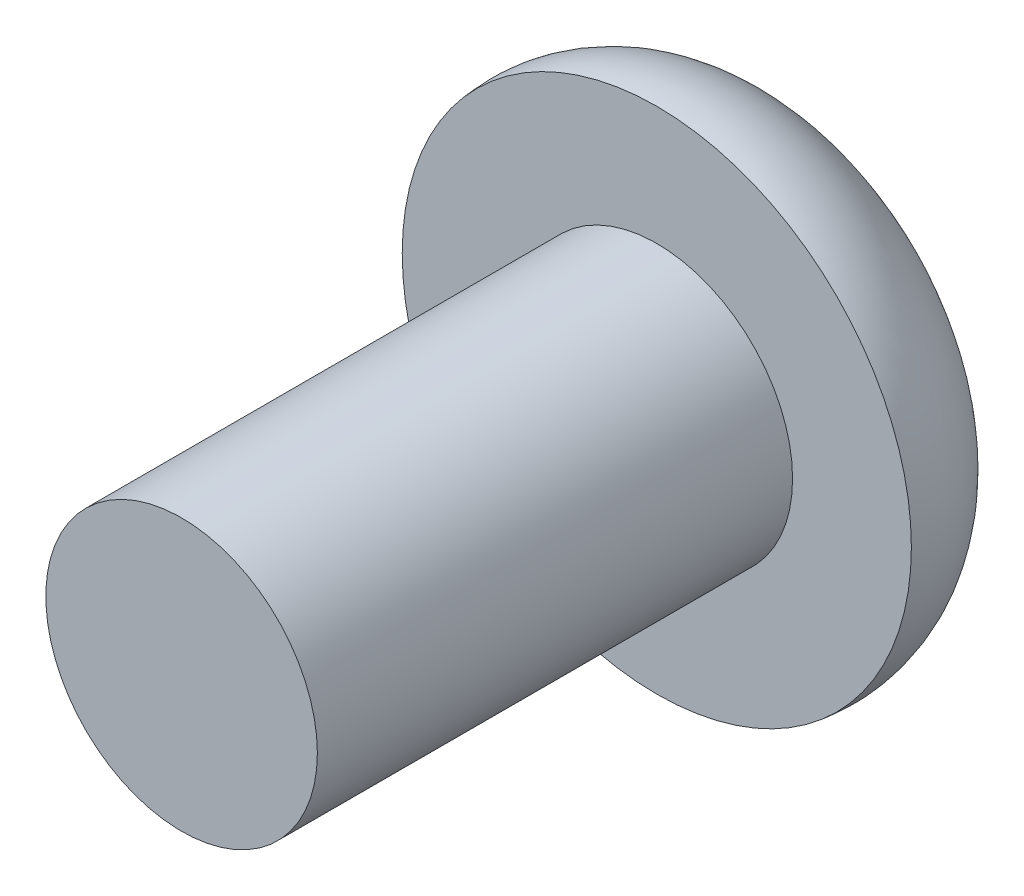
ISO-10303-21;
HEADER;
FILE_DESCRIPTION(('STEP AP214'),'2;1');
FILE_NAME('part.step','',(''),(''),'','','');
FILE_SCHEMA(('AUTOMOTIVE_DESIGN { 1 0 10303 214 1 1 1 1 }'));
ENDSEC;
DATA;
#1=APPLICATION_CONTEXT('core data for automotive mechanical design processes');
#2=APPLICATION_PROTOCOL_DEFINITION('international standard','automotive_design',2000,#1);
#3=PRODUCT_CONTEXT('',#1,'mechanical');
#4=PRODUCT('Part','Part','',(#3));
#5=PRODUCT_RELATED_PRODUCT_CATEGORY('part','',(#4));
#6=PRODUCT_DEFINITION_FORMATION('','',#4);
#7=PRODUCT_DEFINITION_CONTEXT('part definition',#1,'design');
#8=PRODUCT_DEFINITION('design','',#6,#7);
#9=PRODUCT_DEFINITION_SHAPE('','',#8);
#10=(LENGTH_UNIT() NAMED_UNIT(*) SI_UNIT(.MILLI.,.METRE.));
#11=(NAMED_UNIT(*) PLANE_ANGLE_UNIT() SI_UNIT($,.RADIAN.));
#12=(NAMED_UNIT(*) SI_UNIT($,.STERADIAN.) SOLID_ANGLE_UNIT());
#13=UNCERTAINTY_MEASURE_WITH_UNIT(LENGTH_MEASURE(1.E-05),#10,'distance_accuracy_value','');
#14=(GEOMETRIC_REPRESENTATION_CONTEXT(3) GLOBAL_UNCERTAINTY_ASSIGNED_CONTEXT((#13)) GLOBAL_UNIT_ASSIGNED_CONTEXT((#10,
#11,#12)) REPRESENTATION_CONTEXT('',''));
#15=CARTESIAN_POINT('',(0.,0.,0.));
#16=DIRECTION('',(0.,0.,1.));
#17=DIRECTION('',(1.,0.,0.));
#18=AXIS2_PLACEMENT_3D('',#15,#16,#17);
#19=CARTESIAN_POINT('',(0.,0.,0.));
#20=DIRECTION('',(0.,0.,-1.));
#21=DIRECTION('',(-1.,0.,0.));
#22=AXIS2_PLACEMENT_3D('',#19,#20,#21);
#23=PLANE('',#22);
#24=CARTESIAN_POINT('',(0.,0.,0.));
#25=DIRECTION('',(0.,0.,1.));
#26=DIRECTION('',(1.,0.,0.));
#27=AXIS2_PLACEMENT_3D('',#24,#25,#26);
#28=CIRCLE('',#27,2.);
#29=CARTESIAN_POINT('',(2.,0.,0.));
#30=VERTEX_POINT('',#29);
#31=EDGE_CURVE('E11',#30,#30,#28,.T.);
#32=ORIENTED_EDGE('',*,*,#31,.T.);
#33=EDGE_LOOP('',(#32));
#34=FACE_BOUND('',#33,.T.);
#35=ADVANCED_FACE('F32',(#34),#23,.F.);
#36=CARTESIAN_POINT('',(0.,0.,0.));
#37=DIRECTION('',(0.,0.,1.));
#38=DIRECTION('',(1.,0.,0.));
#39=AXIS2_PLACEMENT_3D('',#36,#37,#38);
#40=CYLINDRICAL_SURFACE('',#39,2.);
#41=ORIENTED_EDGE('',*,*,#31,.F.);
#42=EDGE_LOOP('',(#41));
#43=FACE_BOUND('',#42,.T.);
#44=CARTESIAN_POINT('',(0.,0.,-7.));
#45=DIRECTION('',(0.,0.,1.));
#46=DIRECTION('',(1.,0.,0.));
#47=AXIS2_PLACEMENT_3D('',#44,#45,#46);
#48=CIRCLE('',#47,2.);
#49=CARTESIAN_POINT('',(2.,0.,-7.));
#50=VERTEX_POINT('',#49);
#51=EDGE_CURVE('E39',#50,#50,#48,.T.);
#52=ORIENTED_EDGE('',*,*,#51,.T.);
#53=EDGE_LOOP('',(#52));
#54=FACE_BOUND('',#53,.T.);
#55=ADVANCED_FACE('F146',(#43,#54),#40,.T.);
#56=CARTESIAN_POINT('',(-2.,0.,-7.));
#57=DIRECTION('',(0.,0.,-1.));
#58=DIRECTION('',(-1.,0.,0.));
#59=AXIS2_PLACEMENT_3D('',#56,#57,#58);
#60=PLANE('',#59);
#61=ORIENTED_EDGE('',*,*,#51,.F.);
#62=EDGE_LOOP('',(#61));
#63=FACE_BOUND('',#62,.T.);
#64=CARTESIAN_POINT('',(0.,0.,-7.));
#65=DIRECTION('',(0.,0.,1.));
#66=DIRECTION('',(1.,0.,0.));
#67=AXIS2_PLACEMENT_3D('',#64,#65,#66);
#68=CIRCLE('',#67,3.75);
#69=CARTESIAN_POINT('',(3.75,0.,-7.));
#70=VERTEX_POINT('',#69);
#71=EDGE_CURVE('E141',#70,#70,#68,.T.);
#72=ORIENTED_EDGE('',*,*,#71,.T.);
#73=EDGE_LOOP('',(#72));
#74=FACE_BOUND('',#73,.T.);
#75=ADVANCED_FACE('F148',(#63,#74),#60,.F.);
#76=CARTESIAN_POINT('',(0.,0.,-7.234375));
#77=DIRECTION('',(0.,0.,1.));
#78=DIRECTION('',(1.,0.,0.));
#79=AXIS2_PLACEMENT_3D('',#76,#77,#78);
#80=TOROIDAL_SURFACE('',#79,2.,1.765625);
#81=ORIENTED_EDGE('',*,*,#71,.F.);
#82=EDGE_LOOP('',(#81));
#83=FACE_BOUND('',#82,.T.);
#84=CARTESIAN_POINT('',(0.,0.,-9.));
#85=DIRECTION('',(0.,0.,1.));
#86=DIRECTION('',(1.,0.,0.));
#87=AXIS2_PLACEMENT_3D('',#84,#85,#86);
#88=CIRCLE('',#87,2.);
#89=CARTESIAN_POINT('',(2.,0.,-9.));
#90=VERTEX_POINT('',#89);
#91=EDGE_CURVE('E133',#90,#90,#88,.T.);
#92=ORIENTED_EDGE('',*,*,#91,.T.);
#93=EDGE_LOOP('',(#92));
#94=FACE_BOUND('',#93,.T.);
#95=ADVANCED_FACE('F151',(#83,#94),#80,.T.);
#96=CARTESIAN_POINT('',(-2.,0.,-9.));
#97=DIRECTION('',(0.,0.,1.));
#98=DIRECTION('',(1.,0.,0.));
#99=AXIS2_PLACEMENT_3D('',#96,#97,#98);
#100=PLANE('',#99);
#101=DIRECTION('',(-0.866025403784439,0.5,0.));
#102=VECTOR('',#101,1.);
#103=CARTESIAN_POINT('',(0.,-1.44337567297406,-9.));
#104=LINE('',#103,#102);
#105=CARTESIAN_POINT('',(0.,-1.44337567297406,-9.));
#106=VERTEX_POINT('',#105);
#107=CARTESIAN_POINT('',(-1.25,-0.721687836487033,-9.));
#108=VERTEX_POINT('',#107);
#109=EDGE_CURVE('E120',#106,#108,#104,.T.);
#110=ORIENTED_EDGE('',*,*,#109,.F.);
#111=DIRECTION('',(-0.866025403784439,-0.5,0.));
#112=VECTOR('',#111,1.);
#113=CARTESIAN_POINT('',(1.25,-0.721687836487033,-9.));
#114=LINE('',#113,#112);
#115=CARTESIAN_POINT('',(1.25,-0.721687836487033,-9.));
#116=VERTEX_POINT('',#115);
#117=EDGE_CURVE('E46',#116,#106,#114,.T.);
#118=ORIENTED_EDGE('',*,*,#117,.F.);
#119=DIRECTION('',(0.,-1.,0.));
#120=VECTOR('',#119,1.);
#121=CARTESIAN_POINT('',(1.25,0.721687836487033,-9.));
#122=LINE('',#121,#120);
#123=CARTESIAN_POINT('',(1.25,0.721687836487033,-9.));
#124=VERTEX_POINT('',#123);
#125=EDGE_CURVE('E129',#124,#116,#122,.T.);
#126=ORIENTED_EDGE('',*,*,#125,.F.);
#127=DIRECTION('',(0.866025403784439,-0.5,0.));
#128=VECTOR('',#127,1.);
#129=CARTESIAN_POINT('',(0.,1.44337567297407,-9.));
#130=LINE('',#129,#128);
#131=CARTESIAN_POINT('',(0.,1.44337567297407,-9.));
#132=VERTEX_POINT('',#131);
#133=EDGE_CURVE('E127',#132,#124,#130,.T.);
#134=ORIENTED_EDGE('',*,*,#133,.F.);
#135=DIRECTION('',(0.866025403784439,0.5,0.));
#136=VECTOR('',#135,1.);
#137=CARTESIAN_POINT('',(-1.25,0.721687836487034,-9.));
#138=LINE('',#137,#136);
#139=CARTESIAN_POINT('',(-1.25,0.721687836487034,-9.));
#140=VERTEX_POINT('',#139);
#141=EDGE_CURVE('E94',#140,#132,#138,.T.);
#142=ORIENTED_EDGE('',*,*,#141,.F.);
#143=DIRECTION('',(0.,1.,0.));
#144=VECTOR('',#143,1.);
#145=CARTESIAN_POINT('',(-1.25,-0.721687836487033,-9.));
#146=LINE('',#145,#144);
#147=EDGE_CURVE('E123',#108,#140,#146,.T.);
#148=ORIENTED_EDGE('',*,*,#147,.F.);
#149=EDGE_LOOP('',(#110,#118,#126,#134,#142,#148));
#150=FACE_BOUND('',#149,.T.);
#151=ORIENTED_EDGE('',*,*,#91,.F.);
#152=EDGE_LOOP('',(#151));
#153=FACE_BOUND('',#152,.T.);
#154=ADVANCED_FACE('F157',(#150,#153),#100,.F.);
#155=CARTESIAN_POINT('',(1.25,-0.721687836487033,-7.2));
#156=DIRECTION('',(0.5,-0.866025403784439,0.));
#157=DIRECTION('',(0.866025403784439,0.5,0.));
#158=AXIS2_PLACEMENT_3D('',#155,#156,#157);
#159=PLANE('',#158);
#160=ORIENTED_EDGE('',*,*,#117,.T.);
#161=DIRECTION('',(0.,0.,-1.));
#162=VECTOR('',#161,1.);
#163=CARTESIAN_POINT('',(0.,-1.44337567297406,-7.2));
#164=LINE('',#163,#162);
#165=CARTESIAN_POINT('',(0.,-1.44337567297406,-7.2));
#166=VERTEX_POINT('',#165);
#167=EDGE_CURVE('E76',#166,#106,#164,.T.);
#168=ORIENTED_EDGE('',*,*,#167,.F.);
#169=DIRECTION('',(-0.866025403784439,-0.5,0.));
#170=VECTOR('',#169,1.);
#171=CARTESIAN_POINT('',(1.25,-0.721687836487033,-7.2));
#172=LINE('',#171,#170);
#173=CARTESIAN_POINT('',(1.25,-0.721687836487033,-7.2));
#174=VERTEX_POINT('',#173);
#175=EDGE_CURVE('E131',#174,#166,#172,.T.);
#176=ORIENTED_EDGE('',*,*,#175,.F.);
#177=DIRECTION('',(0.,0.,-1.));
#178=VECTOR('',#177,1.);
#179=CARTESIAN_POINT('',(1.25,-0.721687836487033,-7.2));
#180=LINE('',#179,#178);
#181=EDGE_CURVE('E54',#174,#116,#180,.T.);
#182=ORIENTED_EDGE('',*,*,#181,.T.);
#183=EDGE_LOOP('',(#160,#168,#176,#182));
#184=FACE_BOUND('',#183,.T.);
#185=ADVANCED_FACE('F162',(#184),#159,.F.);
#186=CARTESIAN_POINT('',(1.25,0.721687836487033,-7.2));
#187=DIRECTION('',(1.,0.,0.));
#188=DIRECTION('',(0.,1.,0.));
#189=AXIS2_PLACEMENT_3D('',#186,#187,#188);
#190=PLANE('',#189);
#191=ORIENTED_EDGE('',*,*,#125,.T.);
#192=ORIENTED_EDGE('',*,*,#181,.F.);
#193=DIRECTION('',(0.,-1.,0.));
#194=VECTOR('',#193,1.);
#195=CARTESIAN_POINT('',(1.25,0.721687836487033,-7.2));
#196=LINE('',#195,#194);
#197=CARTESIAN_POINT('',(1.25,0.721687836487033,-7.2));
#198=VERTEX_POINT('',#197);
#199=EDGE_CURVE('E106',#198,#174,#196,.T.);
#200=ORIENTED_EDGE('',*,*,#199,.F.);
#201=DIRECTION('',(0.,0.,-1.));
#202=VECTOR('',#201,1.);
#203=CARTESIAN_POINT('',(1.25,0.721687836487033,-7.2));
#204=LINE('',#203,#202);
#205=EDGE_CURVE('E98',#198,#124,#204,.T.);
#206=ORIENTED_EDGE('',*,*,#205,.T.);
#207=EDGE_LOOP('',(#191,#192,#200,#206));
#208=FACE_BOUND('',#207,.T.);
#209=ADVANCED_FACE('F168',(#208),#190,.F.);
#210=CARTESIAN_POINT('',(0.,1.44337567297407,-7.2));
#211=DIRECTION('',(0.5,0.866025403784439,0.));
#212=DIRECTION('',(-0.866025403784439,0.5,0.));
#213=AXIS2_PLACEMENT_3D('',#210,#211,#212);
#214=PLANE('',#213);
#215=ORIENTED_EDGE('',*,*,#133,.T.);
#216=ORIENTED_EDGE('',*,*,#205,.F.);
#217=DIRECTION('',(0.866025403784439,-0.5,0.));
#218=VECTOR('',#217,1.);
#219=CARTESIAN_POINT('',(0.,1.44337567297407,-7.2));
#220=LINE('',#219,#218);
#221=CARTESIAN_POINT('',(0.,1.44337567297407,-7.2));
#222=VERTEX_POINT('',#221);
#223=EDGE_CURVE('E102',#222,#198,#220,.T.);
#224=ORIENTED_EDGE('',*,*,#223,.F.);
#225=DIRECTION('',(0.,0.,-1.));
#226=VECTOR('',#225,1.);
#227=CARTESIAN_POINT('',(0.,1.44337567297407,-7.2));
#228=LINE('',#227,#226);
#229=EDGE_CURVE('E87',#222,#132,#228,.T.);
#230=ORIENTED_EDGE('',*,*,#229,.T.);
#231=EDGE_LOOP('',(#215,#216,#224,#230));
#232=FACE_BOUND('',#231,.T.);
#233=ADVANCED_FACE('F103',(#232),#214,.F.);
#234=CARTESIAN_POINT('',(-1.25,0.721687836487034,-7.2));
#235=DIRECTION('',(-0.5,0.866025403784439,0.));
#236=DIRECTION('',(-0.866025403784439,-0.5,0.));
#237=AXIS2_PLACEMENT_3D('',#234,#235,#236);
#238=PLANE('',#237);
#239=ORIENTED_EDGE('',*,*,#141,.T.);
#240=ORIENTED_EDGE('',*,*,#229,.F.);
#241=DIRECTION('',(0.866025403784439,0.5,0.));
#242=VECTOR('',#241,1.);
#243=CARTESIAN_POINT('',(-1.25,0.721687836487034,-7.2));
#244=LINE('',#243,#242);
#245=CARTESIAN_POINT('',(-1.25,0.721687836487034,-7.2));
#246=VERTEX_POINT('',#245);
#247=EDGE_CURVE('E91',#246,#222,#244,.T.);
#248=ORIENTED_EDGE('',*,*,#247,.F.);
#249=DIRECTION('',(0.,0.,-1.));
#250=VECTOR('',#249,1.);
#251=CARTESIAN_POINT('',(-1.25,0.721687836487034,-7.2));
#252=LINE('',#251,#250);
#253=EDGE_CURVE('E99',#246,#140,#252,.T.);
#254=ORIENTED_EDGE('',*,*,#253,.T.);
#255=EDGE_LOOP('',(#239,#240,#248,#254));
#256=FACE_BOUND('',#255,.T.);
#257=ADVANCED_FACE('F89',(#256),#238,.F.);
#258=CARTESIAN_POINT('',(-1.25,-0.721687836487033,-7.2));
#259=DIRECTION('',(-1.,0.,0.));
#260=DIRECTION('',(0.,0.,1.));
#261=AXIS2_PLACEMENT_3D('',#258,#259,#260);
#262=PLANE('',#261);
#263=ORIENTED_EDGE('',*,*,#147,.T.);
#264=ORIENTED_EDGE('',*,*,#253,.F.);
#265=DIRECTION('',(0.,1.,0.));
#266=VECTOR('',#265,1.);
#267=CARTESIAN_POINT('',(-1.25,-0.721687836487033,-7.2));
#268=LINE('',#267,#266);
#269=CARTESIAN_POINT('',(-1.25,-0.721687836487033,-7.2));
#270=VERTEX_POINT('',#269);
#271=EDGE_CURVE('E112',#270,#246,#268,.T.);
#272=ORIENTED_EDGE('',*,*,#271,.F.);
#273=DIRECTION('',(0.,0.,-1.));
#274=VECTOR('',#273,1.);
#275=CARTESIAN_POINT('',(-1.25,-0.721687836487033,-7.2));
#276=LINE('',#275,#274);
#277=EDGE_CURVE('E136',#270,#108,#276,.T.);
#278=ORIENTED_EDGE('',*,*,#277,.T.);
#279=EDGE_LOOP('',(#263,#264,#272,#278));
#280=FACE_BOUND('',#279,.T.);
#281=ADVANCED_FACE('F223',(#280),#262,.F.);
#282=CARTESIAN_POINT('',(0.,-1.44337567297406,-7.2));
#283=DIRECTION('',(-0.5,-0.866025403784439,0.));
#284=DIRECTION('',(0.866025403784439,-0.5,0.));
#285=AXIS2_PLACEMENT_3D('',#282,#283,#284);
#286=PLANE('',#285);
#287=ORIENTED_EDGE('',*,*,#109,.T.);
#288=ORIENTED_EDGE('',*,*,#277,.F.);
#289=DIRECTION('',(-0.866025403784439,0.5,0.));
#290=VECTOR('',#289,1.);
#291=CARTESIAN_POINT('',(0.,-1.44337567297406,-7.2));
#292=LINE('',#291,#290);
#293=EDGE_CURVE('E114',#166,#270,#292,.T.);
#294=ORIENTED_EDGE('',*,*,#293,.F.);
#295=ORIENTED_EDGE('',*,*,#167,.T.);
#296=EDGE_LOOP('',(#287,#288,#294,#295));
#297=FACE_BOUND('',#296,.T.);
#298=ADVANCED_FACE('F232',(#297),#286,.F.);
#299=CARTESIAN_POINT('',(0.,0.,-7.2));
#300=DIRECTION('',(0.,0.,-1.));
#301=DIRECTION('',(-1.,0.,0.));
#302=AXIS2_PLACEMENT_3D('',#299,#300,#301);
#303=PLANE('',#302);
#304=ORIENTED_EDGE('',*,*,#175,.T.);
#305=ORIENTED_EDGE('',*,*,#293,.T.);
#306=ORIENTED_EDGE('',*,*,#271,.T.);
#307=ORIENTED_EDGE('',*,*,#247,.T.);
#308=ORIENTED_EDGE('',*,*,#223,.T.);
#309=ORIENTED_EDGE('',*,*,#199,.T.);
#310=EDGE_LOOP('',(#304,#305,#306,#307,#308,#309));
#311=FACE_BOUND('',#310,.T.);
#312=ADVANCED_FACE('F109',(#311),#303,.T.);
#313=CLOSED_SHELL('',(#35,#55,#75,#95,#154,#185,#209,#233,#257,#281,#298,#312));
#314=MANIFOLD_SOLID_BREP('B2',#313);
#315=ADVANCED_BREP_SHAPE_REPRESENTATION('',(#18,#314),#14);
#316=SHAPE_DEFINITION_REPRESENTATION(#9,#315);
ENDSEC;
END-ISO-10303-21;
